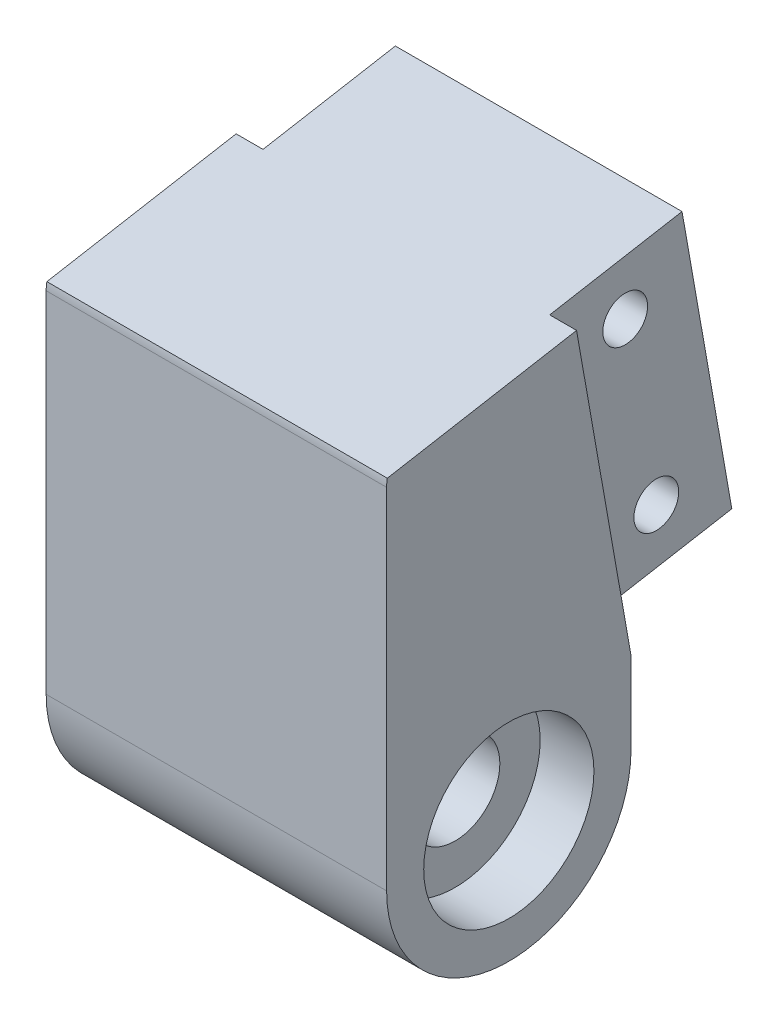
ISO-10303-21;
HEADER;
FILE_DESCRIPTION(('STEP AP214'),'2;1');
FILE_NAME('part.step','',(''),(''),'','','');
FILE_SCHEMA(('AUTOMOTIVE_DESIGN { 1 0 10303 214 1 1 1 1 }'));
ENDSEC;
DATA;
#1=APPLICATION_CONTEXT('core data for automotive mechanical design processes');
#2=APPLICATION_PROTOCOL_DEFINITION('international standard','automotive_design',2000,#1);
#3=PRODUCT_CONTEXT('',#1,'mechanical');
#4=PRODUCT('Part','Part','',(#3));
#5=PRODUCT_RELATED_PRODUCT_CATEGORY('part','',(#4));
#6=PRODUCT_DEFINITION_FORMATION('','',#4);
#7=PRODUCT_DEFINITION_CONTEXT('part definition',#1,'design');
#8=PRODUCT_DEFINITION('design','',#6,#7);
#9=PRODUCT_DEFINITION_SHAPE('','',#8);
#10=(LENGTH_UNIT() NAMED_UNIT(*) SI_UNIT(.MILLI.,.METRE.));
#11=(NAMED_UNIT(*) PLANE_ANGLE_UNIT() SI_UNIT($,.RADIAN.));
#12=(NAMED_UNIT(*) SI_UNIT($,.STERADIAN.) SOLID_ANGLE_UNIT());
#13=UNCERTAINTY_MEASURE_WITH_UNIT(LENGTH_MEASURE(1.E-05),#10,'distance_accuracy_value','');
#14=(GEOMETRIC_REPRESENTATION_CONTEXT(3) GLOBAL_UNCERTAINTY_ASSIGNED_CONTEXT((#13)) GLOBAL_UNIT_ASSIGNED_CONTEXT((#10,
#11,#12)) REPRESENTATION_CONTEXT('',''));
#15=CARTESIAN_POINT('',(0.,0.,0.));
#16=DIRECTION('',(0.,0.,1.));
#17=DIRECTION('',(1.,0.,0.));
#18=AXIS2_PLACEMENT_3D('',#15,#16,#17);
#19=CARTESIAN_POINT('',(38.,-47.7020089959167,-27.8501518989397));
#20=DIRECTION('',(-1.,0.,0.));
#21=DIRECTION('',(0.,0.,1.));
#22=AXIS2_PLACEMENT_3D('',#19,#20,#21);
#23=CYLINDRICAL_SURFACE('',#22,4.99999999999999);
#24=CARTESIAN_POINT('',(32.,-47.7020089959167,-27.8501518989397));
#25=DIRECTION('',(1.,0.,0.));
#26=DIRECTION('',(0.,0.,-1.));
#27=AXIS2_PLACEMENT_3D('',#24,#25,#26);
#28=CIRCLE('',#27,4.99999999999999);
#29=CARTESIAN_POINT('',(32.,-47.7020089959167,-32.8501518989397));
#30=VERTEX_POINT('',#29);
#31=EDGE_CURVE('E167',#30,#30,#28,.T.);
#32=ORIENTED_EDGE('',*,*,#31,.T.);
#33=EDGE_LOOP('',(#32));
#34=FACE_BOUND('',#33,.T.);
#35=CARTESIAN_POINT('',(6.,-47.7020089959167,-27.8501518989397));
#36=DIRECTION('',(-1.,0.,0.));
#37=DIRECTION('',(0.,0.,1.));
#38=AXIS2_PLACEMENT_3D('',#35,#36,#37);
#39=CIRCLE('',#38,4.99999999999999);
#40=CARTESIAN_POINT('',(6.,-47.7020089959167,-22.8501518989397));
#41=VERTEX_POINT('',#40);
#42=EDGE_CURVE('E45',#41,#41,#39,.T.);
#43=ORIENTED_EDGE('',*,*,#42,.T.);
#44=EDGE_LOOP('',(#43));
#45=FACE_BOUND('',#44,.T.);
#46=ADVANCED_FACE('F41',(#34,#45),#23,.F.);
#47=CARTESIAN_POINT('',(38.,-47.7020089959167,-27.8501518989397));
#48=DIRECTION('',(1.,0.,0.));
#49=DIRECTION('',(0.,0.,-1.));
#50=AXIS2_PLACEMENT_3D('',#47,#48,#49);
#51=PLANE('',#50);
#52=DIRECTION('',(0.,0.173648177666928,-0.984807753012209));
#53=VECTOR('',#52,1.);
#54=CARTESIAN_POINT('',(38.,-9.47291370118873,-5.06446998400453));
#55=LINE('',#54,#53);
#56=CARTESIAN_POINT('',(38.,-7.8465464301066,-14.288057120514));
#57=VERTEX_POINT('',#56);
#58=CARTESIAN_POINT('',(38.,-4.12177908221862,-35.4122624628971));
#59=VERTEX_POINT('',#58);
#60=EDGE_CURVE('E131',#57,#59,#55,.T.);
#61=ORIENTED_EDGE('',*,*,#60,.F.);
#62=CARTESIAN_POINT('',(38.,-8.69026792378634,-18.8299500080836));
#63=DIRECTION('',(1.,0.,0.));
#64=DIRECTION('',(0.,0.,-1.));
#65=AXIS2_PLACEMENT_3D('',#62,#63,#64);
#66=CIRCLE('',#65,4.61959489144369);
#67=CARTESIAN_POINT('',(38.,-8.69026792378634,-14.2103551166399));
#68=VERTEX_POINT('',#67);
#69=EDGE_CURVE('E95',#57,#68,#66,.T.);
#70=ORIENTED_EDGE('',*,*,#69,.T.);
#71=DIRECTION('',(0.,-1.,0.));
#72=VECTOR('',#71,1.);
#73=CARTESIAN_POINT('',(38.,-47.7020089959167,-14.2103551166399));
#74=LINE('',#73,#72);
#75=CARTESIAN_POINT('',(38.,-47.7020089959167,-14.2103551166399));
#76=VERTEX_POINT('',#75);
#77=EDGE_CURVE('E172',#68,#76,#74,.T.);
#78=ORIENTED_EDGE('',*,*,#77,.T.);
#79=CARTESIAN_POINT('',(38.,-47.7020089959167,-27.8501518989397));
#80=DIRECTION('',(1.,0.,0.));
#81=DIRECTION('',(0.,0.,-1.));
#82=AXIS2_PLACEMENT_3D('',#79,#80,#81);
#83=CIRCLE('',#82,13.6397967822998);
#84=CARTESIAN_POINT('',(38.,-47.7020089959167,-41.4899486812395));
#85=VERTEX_POINT('',#84);
#86=EDGE_CURVE('E175',#76,#85,#83,.T.);
#87=ORIENTED_EDGE('',*,*,#86,.T.);
#88=DIRECTION('',(0.,1.,0.));
#89=VECTOR('',#88,1.);
#90=CARTESIAN_POINT('',(38.,-38.5900504376459,-41.4899486812395));
#91=LINE('',#90,#89);
#92=CARTESIAN_POINT('',(38.,-38.5900504376459,-41.4899486812395));
#93=VERTEX_POINT('',#92);
#94=EDGE_CURVE('E150',#85,#93,#91,.T.);
#95=ORIENTED_EDGE('',*,*,#94,.T.);
#96=DIRECTION('',(0.,-0.984807753012209,-0.173648177666928));
#97=VECTOR('',#96,1.);
#98=CARTESIAN_POINT('',(38.,-38.5900504376459,-41.4899486812395));
#99=LINE('',#98,#97);
#100=EDGE_CURVE('E67',#59,#93,#99,.T.);
#101=ORIENTED_EDGE('',*,*,#100,.F.);
#102=EDGE_LOOP('',(#61,#70,#78,#87,#95,#101));
#103=FACE_BOUND('',#102,.T.);
#104=CARTESIAN_POINT('',(38.,-47.7020089959167,-27.8501518989397));
#105=DIRECTION('',(1.,0.,0.));
#106=DIRECTION('',(0.,0.,-1.));
#107=AXIS2_PLACEMENT_3D('',#104,#105,#106);
#108=CIRCLE('',#107,9.5);
#109=CARTESIAN_POINT('',(38.,-47.7020089959167,-37.3501518989397));
#110=VERTEX_POINT('',#109);
#111=EDGE_CURVE('E168',#110,#110,#108,.T.);
#112=ORIENTED_EDGE('',*,*,#111,.F.);
#113=EDGE_LOOP('',(#112));
#114=FACE_BOUND('',#113,.T.);
#115=ADVANCED_FACE('F147',(#103,#114),#51,.T.);
#116=CARTESIAN_POINT('',(0.,-47.7020089959167,-27.8501518989397));
#117=DIRECTION('',(1.,0.,0.));
#118=DIRECTION('',(0.,0.,-1.));
#119=AXIS2_PLACEMENT_3D('',#116,#117,#118);
#120=PLANE('',#119);
#121=CARTESIAN_POINT('',(0.,-47.7020089959167,-27.8501518989397));
#122=DIRECTION('',(1.,0.,0.));
#123=DIRECTION('',(0.,0.,-1.));
#124=AXIS2_PLACEMENT_3D('',#121,#122,#123);
#125=CIRCLE('',#124,9.5);
#126=CARTESIAN_POINT('',(0.,-47.7020089959167,-37.3501518989397));
#127=VERTEX_POINT('',#126);
#128=EDGE_CURVE('E152',#127,#127,#125,.T.);
#129=ORIENTED_EDGE('',*,*,#128,.T.);
#130=EDGE_LOOP('',(#129));
#131=FACE_BOUND('',#130,.T.);
#132=CARTESIAN_POINT('',(0.,-8.69026792378634,-18.8299500080836));
#133=DIRECTION('',(1.,0.,0.));
#134=DIRECTION('',(0.,0.,-1.));
#135=AXIS2_PLACEMENT_3D('',#132,#133,#134);
#136=CIRCLE('',#135,4.61959489144369);
#137=CARTESIAN_POINT('',(0.,-7.8465464301066,-14.288057120514));
#138=VERTEX_POINT('',#137);
#139=CARTESIAN_POINT('',(0.,-8.69026792378634,-14.2103551166399));
#140=VERTEX_POINT('',#139);
#141=EDGE_CURVE('E179',#138,#140,#136,.T.);
#142=ORIENTED_EDGE('',*,*,#141,.F.);
#143=DIRECTION('',(0.,0.173648177666928,-0.984807753012209));
#144=VECTOR('',#143,1.);
#145=CARTESIAN_POINT('',(0.,-9.47291370118873,-5.06446998400453));
#146=LINE('',#145,#144);
#147=CARTESIAN_POINT('',(0.,-4.12177908221862,-35.4122624628971));
#148=VERTEX_POINT('',#147);
#149=EDGE_CURVE('E138',#138,#148,#146,.T.);
#150=ORIENTED_EDGE('',*,*,#149,.T.);
#151=DIRECTION('',(0.,0.984807753012209,0.173648177666928));
#152=VECTOR('',#151,1.);
#153=CARTESIAN_POINT('',(0.,-38.5900504376459,-41.4899486812395));
#154=LINE('',#153,#152);
#155=CARTESIAN_POINT('',(0.,-38.5900504376459,-41.4899486812395));
#156=VERTEX_POINT('',#155);
#157=EDGE_CURVE('E153',#156,#148,#154,.T.);
#158=ORIENTED_EDGE('',*,*,#157,.F.);
#159=DIRECTION('',(0.,1.,0.));
#160=VECTOR('',#159,1.);
#161=CARTESIAN_POINT('',(0.,-38.5900504376459,-41.4899486812395));
#162=LINE('',#161,#160);
#163=CARTESIAN_POINT('',(0.,-47.7020089959167,-41.4899486812395));
#164=VERTEX_POINT('',#163);
#165=EDGE_CURVE('E173',#164,#156,#162,.T.);
#166=ORIENTED_EDGE('',*,*,#165,.F.);
#167=CARTESIAN_POINT('',(0.,-47.7020089959167,-27.8501518989397));
#168=DIRECTION('',(1.,0.,0.));
#169=DIRECTION('',(0.,0.,-1.));
#170=AXIS2_PLACEMENT_3D('',#167,#168,#169);
#171=CIRCLE('',#170,13.6397967822998);
#172=CARTESIAN_POINT('',(0.,-47.7020089959167,-14.2103551166399));
#173=VERTEX_POINT('',#172);
#174=EDGE_CURVE('E87',#173,#164,#171,.T.);
#175=ORIENTED_EDGE('',*,*,#174,.F.);
#176=DIRECTION('',(0.,-1.,0.));
#177=VECTOR('',#176,1.);
#178=CARTESIAN_POINT('',(0.,-47.7020089959167,-14.2103551166399));
#179=LINE('',#178,#177);
#180=EDGE_CURVE('E181',#140,#173,#179,.T.);
#181=ORIENTED_EDGE('',*,*,#180,.F.);
#182=EDGE_LOOP('',(#142,#150,#158,#166,#175,#181));
#183=FACE_BOUND('',#182,.T.);
#184=ADVANCED_FACE('F208',(#131,#183),#120,.F.);
#185=CARTESIAN_POINT('',(38.,-8.69026792378634,-18.8299500080836));
#186=DIRECTION('',(-1.,0.,0.));
#187=DIRECTION('',(0.,0.,1.));
#188=AXIS2_PLACEMENT_3D('',#185,#186,#187);
#189=CYLINDRICAL_SURFACE('',#188,4.61959489144369);
#190=ORIENTED_EDGE('',*,*,#69,.F.);
#191=DIRECTION('',(-1.,0.,0.));
#192=VECTOR('',#191,1.);
#193=CARTESIAN_POINT('',(38.,-7.8465464301066,-14.288057120514));
#194=LINE('',#193,#192);
#195=EDGE_CURVE('E137',#57,#138,#194,.T.);
#196=ORIENTED_EDGE('',*,*,#195,.T.);
#197=ORIENTED_EDGE('',*,*,#141,.T.);
#198=DIRECTION('',(-1.,0.,0.));
#199=VECTOR('',#198,1.);
#200=CARTESIAN_POINT('',(38.,-8.69026792378634,-14.2103551166399));
#201=LINE('',#200,#199);
#202=EDGE_CURVE('E11',#68,#140,#201,.T.);
#203=ORIENTED_EDGE('',*,*,#202,.F.);
#204=EDGE_LOOP('',(#190,#196,#197,#203));
#205=FACE_BOUND('',#204,.T.);
#206=ADVANCED_FACE('F214',(#205),#189,.T.);
#207=CARTESIAN_POINT('',(38.,-47.7020089959167,-14.2103551166399));
#208=DIRECTION('',(0.,0.,-1.));
#209=DIRECTION('',(-1.,0.,0.));
#210=AXIS2_PLACEMENT_3D('',#207,#208,#209);
#211=PLANE('',#210);
#212=ORIENTED_EDGE('',*,*,#180,.T.);
#213=DIRECTION('',(-1.,0.,0.));
#214=VECTOR('',#213,1.);
#215=CARTESIAN_POINT('',(38.,-47.7020089959167,-14.2103551166399));
#216=LINE('',#215,#214);
#217=EDGE_CURVE('E50',#76,#173,#216,.T.);
#218=ORIENTED_EDGE('',*,*,#217,.F.);
#219=ORIENTED_EDGE('',*,*,#77,.F.);
#220=ORIENTED_EDGE('',*,*,#202,.T.);
#221=EDGE_LOOP('',(#212,#218,#219,#220));
#222=FACE_BOUND('',#221,.T.);
#223=ADVANCED_FACE('F226',(#222),#211,.F.);
#224=CARTESIAN_POINT('',(38.,-47.7020089959167,-27.8501518989397));
#225=DIRECTION('',(-1.,0.,0.));
#226=DIRECTION('',(0.,0.,1.));
#227=AXIS2_PLACEMENT_3D('',#224,#225,#226);
#228=CYLINDRICAL_SURFACE('',#227,13.6397967822998);
#229=ORIENTED_EDGE('',*,*,#174,.T.);
#230=DIRECTION('',(-1.,0.,0.));
#231=VECTOR('',#230,1.);
#232=CARTESIAN_POINT('',(38.,-47.7020089959167,-41.4899486812395));
#233=LINE('',#232,#231);
#234=EDGE_CURVE('E187',#85,#164,#233,.T.);
#235=ORIENTED_EDGE('',*,*,#234,.F.);
#236=ORIENTED_EDGE('',*,*,#86,.F.);
#237=ORIENTED_EDGE('',*,*,#217,.T.);
#238=EDGE_LOOP('',(#229,#235,#236,#237));
#239=FACE_BOUND('',#238,.T.);
#240=ADVANCED_FACE('F222',(#239),#228,.T.);
#241=CARTESIAN_POINT('',(38.,-38.5900504376459,-41.4899486812395));
#242=DIRECTION('',(0.,0.,1.));
#243=DIRECTION('',(1.,0.,0.));
#244=AXIS2_PLACEMENT_3D('',#241,#242,#243);
#245=PLANE('',#244);
#246=ORIENTED_EDGE('',*,*,#165,.T.);
#247=DIRECTION('',(-1.,0.,0.));
#248=VECTOR('',#247,1.);
#249=CARTESIAN_POINT('',(38.,-38.5900504376459,-41.4899486812395));
#250=LINE('',#249,#248);
#251=EDGE_CURVE('E178',#93,#156,#250,.T.);
#252=ORIENTED_EDGE('',*,*,#251,.F.);
#253=ORIENTED_EDGE('',*,*,#94,.F.);
#254=ORIENTED_EDGE('',*,*,#234,.T.);
#255=EDGE_LOOP('',(#246,#252,#253,#254));
#256=FACE_BOUND('',#255,.T.);
#257=ADVANCED_FACE('F204',(#256),#245,.F.);
#258=CARTESIAN_POINT('',(32.,-47.7020089959167,-27.8501518989397));
#259=DIRECTION('',(1.,0.,0.));
#260=DIRECTION('',(0.,0.,-1.));
#261=AXIS2_PLACEMENT_3D('',#258,#259,#260);
#262=CYLINDRICAL_SURFACE('',#261,9.5);
#263=CARTESIAN_POINT('',(32.,-47.7020089959167,-27.8501518989397));
#264=DIRECTION('',(1.,0.,0.));
#265=DIRECTION('',(0.,0.,-1.));
#266=AXIS2_PLACEMENT_3D('',#263,#264,#265);
#267=CIRCLE('',#266,9.5);
#268=CARTESIAN_POINT('',(32.,-47.7020089959167,-37.3501518989397));
#269=VERTEX_POINT('',#268);
#270=EDGE_CURVE('E164',#269,#269,#267,.T.);
#271=ORIENTED_EDGE('',*,*,#270,.F.);
#272=EDGE_LOOP('',(#271));
#273=FACE_BOUND('',#272,.T.);
#274=ORIENTED_EDGE('',*,*,#111,.T.);
#275=EDGE_LOOP('',(#274));
#276=FACE_BOUND('',#275,.T.);
#277=ADVANCED_FACE('F198',(#273,#276),#262,.F.);
#278=CARTESIAN_POINT('',(32.,-47.7020089959167,-27.8501518989397));
#279=DIRECTION('',(1.,0.,0.));
#280=DIRECTION('',(0.,0.,-1.));
#281=AXIS2_PLACEMENT_3D('',#278,#279,#280);
#282=PLANE('',#281);
#283=ORIENTED_EDGE('',*,*,#31,.F.);
#284=EDGE_LOOP('',(#283));
#285=FACE_BOUND('',#284,.T.);
#286=ORIENTED_EDGE('',*,*,#270,.T.);
#287=EDGE_LOOP('',(#286));
#288=FACE_BOUND('',#287,.T.);
#289=ADVANCED_FACE('F194',(#285,#288),#282,.T.);
#290=CARTESIAN_POINT('',(6.,-47.7020089959167,-27.8501518989397));
#291=DIRECTION('',(-1.,0.,0.));
#292=DIRECTION('',(0.,0.,1.));
#293=AXIS2_PLACEMENT_3D('',#290,#291,#292);
#294=CYLINDRICAL_SURFACE('',#293,9.5);
#295=CARTESIAN_POINT('',(6.,-47.7020089959167,-27.8501518989397));
#296=DIRECTION('',(1.,0.,0.));
#297=DIRECTION('',(0.,0.,-1.));
#298=AXIS2_PLACEMENT_3D('',#295,#296,#297);
#299=CIRCLE('',#298,9.5);
#300=CARTESIAN_POINT('',(6.,-47.7020089959167,-37.3501518989397));
#301=VERTEX_POINT('',#300);
#302=EDGE_CURVE('E156',#301,#301,#299,.T.);
#303=ORIENTED_EDGE('',*,*,#302,.T.);
#304=EDGE_LOOP('',(#303));
#305=FACE_BOUND('',#304,.T.);
#306=ORIENTED_EDGE('',*,*,#128,.F.);
#307=EDGE_LOOP('',(#306));
#308=FACE_BOUND('',#307,.T.);
#309=ADVANCED_FACE('F197',(#305,#308),#294,.F.);
#310=CARTESIAN_POINT('',(6.,-47.7020089959167,-27.8501518989397));
#311=DIRECTION('',(-1.,0.,0.));
#312=DIRECTION('',(0.,0.,-1.));
#313=AXIS2_PLACEMENT_3D('',#310,#311,#312);
#314=PLANE('',#313);
#315=ORIENTED_EDGE('',*,*,#42,.F.);
#316=EDGE_LOOP('',(#315));
#317=FACE_BOUND('',#316,.T.);
#318=ORIENTED_EDGE('',*,*,#302,.F.);
#319=EDGE_LOOP('',(#318));
#320=FACE_BOUND('',#319,.T.);
#321=ADVANCED_FACE('F318',(#317,#320),#314,.T.);
#322=CARTESIAN_POINT('',(0.,5.93156669444901,-33.6395863560791));
#323=DIRECTION('',(0.,-0.173648177666928,0.984807753012209));
#324=DIRECTION('',(0.,-0.984807753012209,-0.173648177666928));
#325=AXIS2_PLACEMENT_3D('',#322,#323,#324);
#326=PLANE('',#325);
#327=ORIENTED_EDGE('',*,*,#157,.T.);
#328=DIRECTION('',(-1.,0.,0.));
#329=VECTOR('',#328,1.);
#330=CARTESIAN_POINT('',(38.,-4.12177908221862,-35.4122624628971));
#331=LINE('',#330,#329);
#332=CARTESIAN_POINT('',(3.,-4.12177908221862,-35.4122624628971));
#333=VERTEX_POINT('',#332);
#334=EDGE_CURVE('E145',#333,#148,#331,.T.);
#335=ORIENTED_EDGE('',*,*,#334,.F.);
#336=DIRECTION('',(0.,0.984807753012209,0.173648177666928));
#337=VECTOR('',#336,1.);
#338=CARTESIAN_POINT('',(3.,-4.12177908221862,-35.4122624628971));
#339=LINE('',#338,#337);
#340=CARTESIAN_POINT('',(3.,-35.6356271786093,-40.9690041482388));
#341=VERTEX_POINT('',#340);
#342=EDGE_CURVE('E248',#341,#333,#339,.T.);
#343=ORIENTED_EDGE('',*,*,#342,.F.);
#344=DIRECTION('',(-1.,0.,0.));
#345=VECTOR('',#344,1.);
#346=CARTESIAN_POINT('',(35.,-35.6356271786093,-40.9690041482388));
#347=LINE('',#346,#345);
#348=CARTESIAN_POINT('',(35.,-35.6356271786093,-40.9690041482388));
#349=VERTEX_POINT('',#348);
#350=EDGE_CURVE('E253',#349,#341,#347,.T.);
#351=ORIENTED_EDGE('',*,*,#350,.F.);
#352=DIRECTION('',(0.,-0.984807753012209,-0.173648177666928));
#353=VECTOR('',#352,1.);
#354=CARTESIAN_POINT('',(35.,-4.12177908221862,-35.4122624628971));
#355=LINE('',#354,#353);
#356=CARTESIAN_POINT('',(35.,-4.12177908221862,-35.4122624628971));
#357=VERTEX_POINT('',#356);
#358=EDGE_CURVE('E144',#357,#349,#355,.T.);
#359=ORIENTED_EDGE('',*,*,#358,.F.);
#360=EDGE_CURVE('E134',#59,#357,#331,.T.);
#361=ORIENTED_EDGE('',*,*,#360,.F.);
#362=ORIENTED_EDGE('',*,*,#100,.T.);
#363=ORIENTED_EDGE('',*,*,#251,.T.);
#364=EDGE_LOOP('',(#327,#335,#343,#351,#359,#361,#362,#363));
#365=FACE_BOUND('',#364,.T.);
#366=ADVANCED_FACE('F141',(#365),#326,.F.);
#367=CARTESIAN_POINT('',(3.,-4.12177908221862,-35.4122624628971));
#368=DIRECTION('',(-1.,0.,0.));
#369=DIRECTION('',(0.,-1.,0.));
#370=AXIS2_PLACEMENT_3D('',#367,#368,#369);
#371=PLANE('',#370);
#372=CARTESIAN_POINT('',(3.,-28.4244193280341,-47.3131732298288));
#373=DIRECTION('',(-1.,0.,0.));
#374=DIRECTION('',(0.,-1.,0.));
#375=AXIS2_PLACEMENT_3D('',#372,#373,#374);
#376=CIRCLE('',#375,2.5);
#377=CARTESIAN_POINT('',(3.,-30.9244193280341,-47.3131732298288));
#378=VERTEX_POINT('',#377);
#379=EDGE_CURVE('E284',#378,#378,#376,.T.);
#380=ORIENTED_EDGE('',*,*,#379,.F.);
#381=EDGE_LOOP('',(#380));
#382=FACE_BOUND('',#381,.T.);
#383=CARTESIAN_POINT('',(3.,-8.72826426778992,-43.8402096764902));
#384=DIRECTION('',(-1.,0.,0.));
#385=DIRECTION('',(0.,-1.,0.));
#386=AXIS2_PLACEMENT_3D('',#383,#384,#385);
#387=CIRCLE('',#386,2.5);
#388=CARTESIAN_POINT('',(3.,-11.2282642677899,-43.8402096764902));
#389=VERTEX_POINT('',#388);
#390=EDGE_CURVE('E278',#389,#389,#387,.T.);
#391=ORIENTED_EDGE('',*,*,#390,.F.);
#392=EDGE_LOOP('',(#391));
#393=FACE_BOUND('',#392,.T.);
#394=DIRECTION('',(0.,0.984807753012209,0.173648177666928));
#395=VECTOR('',#394,1.);
#396=CARTESIAN_POINT('',(3.,-1.51705641721471,-50.1843787580802));
#397=LINE('',#396,#395);
#398=CARTESIAN_POINT('',(3.,-33.0309045136054,-55.7411204434219));
#399=VERTEX_POINT('',#398);
#400=CARTESIAN_POINT('',(3.,-1.51705641721471,-50.1843787580802));
#401=VERTEX_POINT('',#400);
#402=EDGE_CURVE('E244',#399,#401,#397,.T.);
#403=ORIENTED_EDGE('',*,*,#402,.F.);
#404=DIRECTION('',(0.,0.173648177666928,-0.984807753012209));
#405=VECTOR('',#404,1.);
#406=CARTESIAN_POINT('',(3.,-35.6356271786093,-40.9690041482388));
#407=LINE('',#406,#405);
#408=EDGE_CURVE('E158',#341,#399,#407,.T.);
#409=ORIENTED_EDGE('',*,*,#408,.F.);
#410=ORIENTED_EDGE('',*,*,#342,.T.);
#411=DIRECTION('',(0.,0.173648177666928,-0.984807753012209));
#412=VECTOR('',#411,1.);
#413=CARTESIAN_POINT('',(3.,-4.12177908221862,-35.4122624628971));
#414=LINE('',#413,#412);
#415=EDGE_CURVE('E256',#333,#401,#414,.T.);
#416=ORIENTED_EDGE('',*,*,#415,.T.);
#417=EDGE_LOOP('',(#403,#409,#410,#416));
#418=FACE_BOUND('',#417,.T.);
#419=ADVANCED_FACE('F272',(#382,#393,#418),#371,.T.);
#420=CARTESIAN_POINT('',(35.,-35.6356271786093,-40.9690041482388));
#421=DIRECTION('',(0.,-0.984807753012209,-0.173648177666928));
#422=DIRECTION('',(0.,0.173648177666928,-0.984807753012209));
#423=AXIS2_PLACEMENT_3D('',#420,#421,#422);
#424=PLANE('',#423);
#425=DIRECTION('',(-1.,0.,0.));
#426=VECTOR('',#425,1.);
#427=CARTESIAN_POINT('',(35.,-33.0309045136054,-55.7411204434219));
#428=LINE('',#427,#426);
#429=CARTESIAN_POINT('',(35.,-33.0309045136054,-55.7411204434219));
#430=VERTEX_POINT('',#429);
#431=EDGE_CURVE('E251',#430,#399,#428,.T.);
#432=ORIENTED_EDGE('',*,*,#431,.F.);
#433=DIRECTION('',(0.,0.173648177666928,-0.984807753012209));
#434=VECTOR('',#433,1.);
#435=CARTESIAN_POINT('',(35.,-35.6356271786093,-40.9690041482388));
#436=LINE('',#435,#434);
#437=EDGE_CURVE('E266',#349,#430,#436,.T.);
#438=ORIENTED_EDGE('',*,*,#437,.F.);
#439=ORIENTED_EDGE('',*,*,#350,.T.);
#440=ORIENTED_EDGE('',*,*,#408,.T.);
#441=EDGE_LOOP('',(#432,#438,#439,#440));
#442=FACE_BOUND('',#441,.T.);
#443=ADVANCED_FACE('F277',(#442),#424,.T.);
#444=CARTESIAN_POINT('',(35.,-4.12177908221862,-35.4122624628971));
#445=DIRECTION('',(1.,0.,0.));
#446=DIRECTION('',(0.,1.,0.));
#447=AXIS2_PLACEMENT_3D('',#444,#445,#446);
#448=PLANE('',#447);
#449=CARTESIAN_POINT('',(35.,-28.4244193280341,-47.3131732298288));
#450=DIRECTION('',(1.,0.,0.));
#451=DIRECTION('',(0.,0.,-1.));
#452=AXIS2_PLACEMENT_3D('',#449,#450,#451);
#453=CIRCLE('',#452,2.5);
#454=CARTESIAN_POINT('',(35.,-28.4244193280341,-49.8131732298288));
#455=VERTEX_POINT('',#454);
#456=EDGE_CURVE('E289',#455,#455,#453,.T.);
#457=ORIENTED_EDGE('',*,*,#456,.F.);
#458=EDGE_LOOP('',(#457));
#459=FACE_BOUND('',#458,.T.);
#460=CARTESIAN_POINT('',(35.,-8.72826426778992,-43.8402096764902));
#461=DIRECTION('',(1.,0.,0.));
#462=DIRECTION('',(0.,0.,-1.));
#463=AXIS2_PLACEMENT_3D('',#460,#461,#462);
#464=CIRCLE('',#463,2.5);
#465=CARTESIAN_POINT('',(35.,-8.72826426778992,-46.3402096764902));
#466=VERTEX_POINT('',#465);
#467=EDGE_CURVE('E280',#466,#466,#464,.T.);
#468=ORIENTED_EDGE('',*,*,#467,.F.);
#469=EDGE_LOOP('',(#468));
#470=FACE_BOUND('',#469,.T.);
#471=DIRECTION('',(0.,-0.984807753012209,-0.173648177666928));
#472=VECTOR('',#471,1.);
#473=CARTESIAN_POINT('',(35.,-1.51705641721471,-50.1843787580802));
#474=LINE('',#473,#472);
#475=CARTESIAN_POINT('',(35.,-1.51705641721471,-50.1843787580802));
#476=VERTEX_POINT('',#475);
#477=EDGE_CURVE('E58',#476,#430,#474,.T.);
#478=ORIENTED_EDGE('',*,*,#477,.F.);
#479=DIRECTION('',(0.,0.173648177666928,-0.984807753012209));
#480=VECTOR('',#479,1.);
#481=CARTESIAN_POINT('',(35.,-4.12177908221862,-35.4122624628971));
#482=LINE('',#481,#480);
#483=EDGE_CURVE('E268',#357,#476,#482,.T.);
#484=ORIENTED_EDGE('',*,*,#483,.F.);
#485=ORIENTED_EDGE('',*,*,#358,.T.);
#486=ORIENTED_EDGE('',*,*,#437,.T.);
#487=EDGE_LOOP('',(#478,#484,#485,#486));
#488=FACE_BOUND('',#487,.T.);
#489=ADVANCED_FACE('F295',(#459,#470,#488),#448,.T.);
#490=CARTESIAN_POINT('',(35.,-4.12177908221862,-35.4122624628971));
#491=DIRECTION('',(0.,0.984807753012209,0.173648177666928));
#492=DIRECTION('',(0.,-0.173648177666928,0.984807753012209));
#493=AXIS2_PLACEMENT_3D('',#490,#491,#492);
#494=PLANE('',#493);
#495=DIRECTION('',(1.,0.,0.));
#496=VECTOR('',#495,1.);
#497=CARTESIAN_POINT('',(35.,-1.51705641721471,-50.1843787580802));
#498=LINE('',#497,#496);
#499=EDGE_CURVE('E259',#401,#476,#498,.T.);
#500=ORIENTED_EDGE('',*,*,#499,.F.);
#501=ORIENTED_EDGE('',*,*,#415,.F.);
#502=ORIENTED_EDGE('',*,*,#334,.T.);
#503=ORIENTED_EDGE('',*,*,#149,.F.);
#504=ORIENTED_EDGE('',*,*,#195,.F.);
#505=ORIENTED_EDGE('',*,*,#60,.T.);
#506=ORIENTED_EDGE('',*,*,#360,.T.);
#507=ORIENTED_EDGE('',*,*,#483,.T.);
#508=EDGE_LOOP('',(#500,#501,#502,#503,#504,#505,#506,#507));
#509=FACE_BOUND('',#508,.T.);
#510=ADVANCED_FACE('F133',(#509),#494,.T.);
#511=CARTESIAN_POINT('',(38.,1.43736684182191,-49.6634342250794));
#512=DIRECTION('',(0.,-0.173648177666928,0.984807753012209));
#513=DIRECTION('',(0.,-0.984807753012209,-0.173648177666928));
#514=AXIS2_PLACEMENT_3D('',#511,#512,#513);
#515=PLANE('',#514);
#516=ORIENTED_EDGE('',*,*,#402,.T.);
#517=ORIENTED_EDGE('',*,*,#499,.T.);
#518=ORIENTED_EDGE('',*,*,#477,.T.);
#519=ORIENTED_EDGE('',*,*,#431,.T.);
#520=EDGE_LOOP('',(#516,#517,#518,#519));
#521=FACE_BOUND('',#520,.T.);
#522=ADVANCED_FACE('F43',(#521),#515,.F.);
#523=CARTESIAN_POINT('',(0.,-8.72826426778992,-43.8402096764902));
#524=DIRECTION('',(1.,0.,0.));
#525=DIRECTION('',(0.,0.,-1.));
#526=AXIS2_PLACEMENT_3D('',#523,#524,#525);
#527=CYLINDRICAL_SURFACE('',#526,2.5);
#528=ORIENTED_EDGE('',*,*,#390,.T.);
#529=EDGE_LOOP('',(#528));
#530=FACE_BOUND('',#529,.T.);
#531=ORIENTED_EDGE('',*,*,#467,.T.);
#532=EDGE_LOOP('',(#531));
#533=FACE_BOUND('',#532,.T.);
#534=ADVANCED_FACE('F301',(#530,#533),#527,.F.);
#535=CARTESIAN_POINT('',(0.,-28.4244193280341,-47.3131732298288));
#536=DIRECTION('',(1.,0.,0.));
#537=DIRECTION('',(0.,0.,-1.));
#538=AXIS2_PLACEMENT_3D('',#535,#536,#537);
#539=CYLINDRICAL_SURFACE('',#538,2.5);
#540=ORIENTED_EDGE('',*,*,#379,.T.);
#541=EDGE_LOOP('',(#540));
#542=FACE_BOUND('',#541,.T.);
#543=ORIENTED_EDGE('',*,*,#456,.T.);
#544=EDGE_LOOP('',(#543));
#545=FACE_BOUND('',#544,.T.);
#546=ADVANCED_FACE('F293',(#542,#545),#539,.F.);
#547=CLOSED_SHELL('',(#46,#115,#184,#206,#223,#240,#257,#277,#289,#309,#321,#366,#419,#443,#489,
#510,#522,#534,#546));
#548=MANIFOLD_SOLID_BREP('B2',#547);
#549=ADVANCED_BREP_SHAPE_REPRESENTATION('',(#18,#548),#14);
#550=SHAPE_DEFINITION_REPRESENTATION(#9,#549);
ENDSEC;
END-ISO-10303-21;
